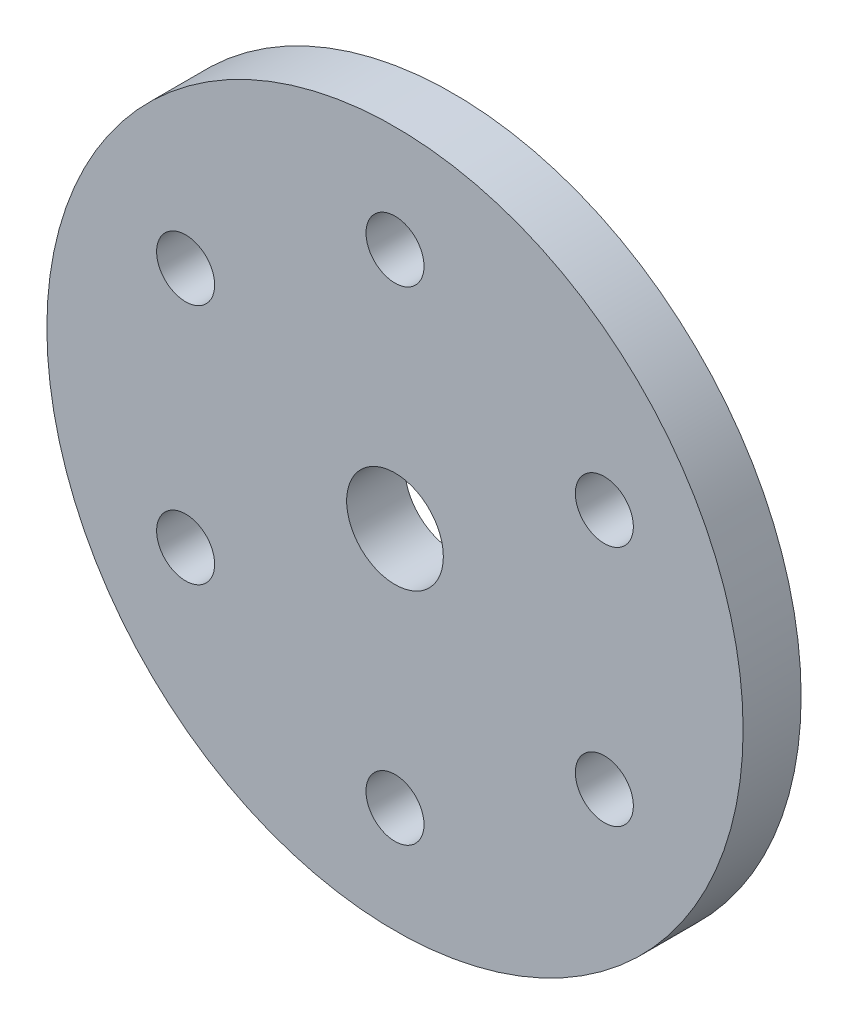
ISO-10303-21;
HEADER;
FILE_DESCRIPTION(('STEP AP214'),'2;1');
FILE_NAME('part.step','',(''),(''),'','','');
FILE_SCHEMA(('AUTOMOTIVE_DESIGN { 1 0 10303 214 1 1 1 1 }'));
ENDSEC;
DATA;
#1=APPLICATION_CONTEXT('core data for automotive mechanical design processes');
#2=APPLICATION_PROTOCOL_DEFINITION('international standard','automotive_design',2000,#1);
#3=PRODUCT_CONTEXT('',#1,'mechanical');
#4=PRODUCT('Part','Part','',(#3));
#5=PRODUCT_RELATED_PRODUCT_CATEGORY('part','',(#4));
#6=PRODUCT_DEFINITION_FORMATION('','',#4);
#7=PRODUCT_DEFINITION_CONTEXT('part definition',#1,'design');
#8=PRODUCT_DEFINITION('design','',#6,#7);
#9=PRODUCT_DEFINITION_SHAPE('','',#8);
#10=(LENGTH_UNIT() NAMED_UNIT(*) SI_UNIT(.MILLI.,.METRE.));
#11=(NAMED_UNIT(*) PLANE_ANGLE_UNIT() SI_UNIT($,.RADIAN.));
#12=(NAMED_UNIT(*) SI_UNIT($,.STERADIAN.) SOLID_ANGLE_UNIT());
#13=UNCERTAINTY_MEASURE_WITH_UNIT(LENGTH_MEASURE(1.E-05),#10,'distance_accuracy_value','');
#14=(GEOMETRIC_REPRESENTATION_CONTEXT(3) GLOBAL_UNCERTAINTY_ASSIGNED_CONTEXT((#13)) GLOBAL_UNIT_ASSIGNED_CONTEXT((#10,
#11,#12)) REPRESENTATION_CONTEXT('',''));
#15=CARTESIAN_POINT('',(0.,0.,0.));
#16=DIRECTION('',(0.,0.,1.));
#17=DIRECTION('',(1.,0.,0.));
#18=AXIS2_PLACEMENT_3D('',#15,#16,#17);
#19=CARTESIAN_POINT('',(0.,0.,3.));
#20=DIRECTION('',(0.,0.,1.));
#21=DIRECTION('',(1.,0.,0.));
#22=AXIS2_PLACEMENT_3D('',#19,#20,#21);
#23=PLANE('',#22);
#24=CARTESIAN_POINT('',(-10.8253175473024,-6.25000000000178,3.));
#25=DIRECTION('',(0.,0.,1.));
#26=DIRECTION('',(1.,0.,0.));
#27=AXIS2_PLACEMENT_3D('',#24,#25,#26);
#28=CIRCLE('',#27,1.5);
#29=CARTESIAN_POINT('',(-9.32531754730242,-6.25000000000178,3.));
#30=VERTEX_POINT('',#29);
#31=EDGE_CURVE('E71',#30,#30,#28,.T.);
#32=ORIENTED_EDGE('',*,*,#31,.F.);
#33=EDGE_LOOP('',(#32));
#34=FACE_BOUND('',#33,.T.);
#35=CARTESIAN_POINT('',(10.8253175473086,-6.24999999999823,3.));
#36=DIRECTION('',(0.,0.,1.));
#37=DIRECTION('',(1.,0.,0.));
#38=AXIS2_PLACEMENT_3D('',#35,#36,#37);
#39=CIRCLE('',#38,1.5);
#40=CARTESIAN_POINT('',(12.3253175473086,-6.24999999999823,3.));
#41=VERTEX_POINT('',#40);
#42=EDGE_CURVE('E59',#41,#41,#39,.T.);
#43=ORIENTED_EDGE('',*,*,#42,.F.);
#44=EDGE_LOOP('',(#43));
#45=FACE_BOUND('',#44,.T.);
#46=CARTESIAN_POINT('',(0.,0.,3.));
#47=DIRECTION('',(0.,0.,1.));
#48=DIRECTION('',(1.,0.,0.));
#49=AXIS2_PLACEMENT_3D('',#46,#47,#48);
#50=CIRCLE('',#49,2.5);
#51=CARTESIAN_POINT('',(2.5,0.,3.));
#52=VERTEX_POINT('',#51);
#53=EDGE_CURVE('E47',#52,#52,#50,.T.);
#54=ORIENTED_EDGE('',*,*,#53,.F.);
#55=EDGE_LOOP('',(#54));
#56=FACE_BOUND('',#55,.T.);
#57=CARTESIAN_POINT('',(0.,0.,3.));
#58=DIRECTION('',(0.,0.,1.));
#59=DIRECTION('',(1.,0.,0.));
#60=AXIS2_PLACEMENT_3D('',#57,#58,#59);
#61=CIRCLE('',#60,18.);
#62=CARTESIAN_POINT('',(18.,0.,3.));
#63=VERTEX_POINT('',#62);
#64=EDGE_CURVE('E10',#63,#63,#61,.T.);
#65=ORIENTED_EDGE('',*,*,#64,.T.);
#66=EDGE_LOOP('',(#65));
#67=FACE_BOUND('',#66,.T.);
#68=CARTESIAN_POINT('',(0.,12.5,3.));
#69=DIRECTION('',(0.,0.,1.));
#70=DIRECTION('',(1.,0.,0.));
#71=AXIS2_PLACEMENT_3D('',#68,#69,#70);
#72=CIRCLE('',#71,1.5);
#73=CARTESIAN_POINT('',(1.5,12.5,3.));
#74=VERTEX_POINT('',#73);
#75=EDGE_CURVE('E42',#74,#74,#72,.T.);
#76=ORIENTED_EDGE('',*,*,#75,.F.);
#77=EDGE_LOOP('',(#76));
#78=FACE_BOUND('',#77,.T.);
#79=CARTESIAN_POINT('',(10.8253175473065,6.25000000000177,3.));
#80=DIRECTION('',(0.,0.,1.));
#81=DIRECTION('',(1.,0.,0.));
#82=AXIS2_PLACEMENT_3D('',#79,#80,#81);
#83=CIRCLE('',#82,1.5);
#84=CARTESIAN_POINT('',(12.3253175473065,6.25000000000177,3.));
#85=VERTEX_POINT('',#84);
#86=EDGE_CURVE('E53',#85,#85,#83,.T.);
#87=ORIENTED_EDGE('',*,*,#86,.F.);
#88=EDGE_LOOP('',(#87));
#89=FACE_BOUND('',#88,.T.);
#90=CARTESIAN_POINT('',(4.0883786618412E-12,-12.5,3.));
#91=DIRECTION('',(0.,0.,1.));
#92=DIRECTION('',(1.,0.,0.));
#93=AXIS2_PLACEMENT_3D('',#90,#91,#92);
#94=CIRCLE('',#93,1.5);
#95=CARTESIAN_POINT('',(1.50000000000409,-12.5,3.));
#96=VERTEX_POINT('',#95);
#97=EDGE_CURVE('E65',#96,#96,#94,.T.);
#98=ORIENTED_EDGE('',*,*,#97,.F.);
#99=EDGE_LOOP('',(#98));
#100=FACE_BOUND('',#99,.T.);
#101=CARTESIAN_POINT('',(-10.8253175473045,6.24999999999822,3.));
#102=DIRECTION('',(0.,0.,1.));
#103=DIRECTION('',(1.,0.,0.));
#104=AXIS2_PLACEMENT_3D('',#101,#102,#103);
#105=CIRCLE('',#104,1.5);
#106=CARTESIAN_POINT('',(-9.32531754730446,6.24999999999822,3.));
#107=VERTEX_POINT('',#106);
#108=EDGE_CURVE('E77',#107,#107,#105,.T.);
#109=ORIENTED_EDGE('',*,*,#108,.F.);
#110=EDGE_LOOP('',(#109));
#111=FACE_BOUND('',#110,.T.);
#112=ADVANCED_FACE('F31',(#34,#45,#56,#67,#78,#89,#100,#111),#23,.T.);
#113=CARTESIAN_POINT('',(0.,0.,0.));
#114=DIRECTION('',(0.,0.,1.));
#115=DIRECTION('',(1.,0.,0.));
#116=AXIS2_PLACEMENT_3D('',#113,#114,#115);
#117=PLANE('',#116);
#118=CARTESIAN_POINT('',(0.,0.,0.));
#119=DIRECTION('',(0.,0.,1.));
#120=DIRECTION('',(1.,0.,0.));
#121=AXIS2_PLACEMENT_3D('',#118,#119,#120);
#122=CIRCLE('',#121,18.);
#123=CARTESIAN_POINT('',(18.,0.,0.));
#124=VERTEX_POINT('',#123);
#125=EDGE_CURVE('E35',#124,#124,#122,.T.);
#126=ORIENTED_EDGE('',*,*,#125,.F.);
#127=EDGE_LOOP('',(#126));
#128=FACE_BOUND('',#127,.T.);
#129=CARTESIAN_POINT('',(0.,12.5,0.));
#130=DIRECTION('',(0.,0.,1.));
#131=DIRECTION('',(1.,0.,0.));
#132=AXIS2_PLACEMENT_3D('',#129,#130,#131);
#133=CIRCLE('',#132,1.5);
#134=CARTESIAN_POINT('',(1.5,12.5,0.));
#135=VERTEX_POINT('',#134);
#136=EDGE_CURVE('E44',#135,#135,#133,.T.);
#137=ORIENTED_EDGE('',*,*,#136,.T.);
#138=EDGE_LOOP('',(#137));
#139=FACE_BOUND('',#138,.T.);
#140=CARTESIAN_POINT('',(0.,0.,0.));
#141=DIRECTION('',(0.,0.,1.));
#142=DIRECTION('',(1.,0.,0.));
#143=AXIS2_PLACEMENT_3D('',#140,#141,#142);
#144=CIRCLE('',#143,2.5);
#145=CARTESIAN_POINT('',(2.5,0.,0.));
#146=VERTEX_POINT('',#145);
#147=EDGE_CURVE('E50',#146,#146,#144,.T.);
#148=ORIENTED_EDGE('',*,*,#147,.T.);
#149=EDGE_LOOP('',(#148));
#150=FACE_BOUND('',#149,.T.);
#151=CARTESIAN_POINT('',(10.8253175473065,6.25000000000177,0.));
#152=DIRECTION('',(0.,0.,1.));
#153=DIRECTION('',(1.,0.,0.));
#154=AXIS2_PLACEMENT_3D('',#151,#152,#153);
#155=CIRCLE('',#154,1.5);
#156=CARTESIAN_POINT('',(12.3253175473065,6.25000000000177,0.));
#157=VERTEX_POINT('',#156);
#158=EDGE_CURVE('E56',#157,#157,#155,.T.);
#159=ORIENTED_EDGE('',*,*,#158,.T.);
#160=EDGE_LOOP('',(#159));
#161=FACE_BOUND('',#160,.T.);
#162=CARTESIAN_POINT('',(10.8253175473086,-6.24999999999823,0.));
#163=DIRECTION('',(0.,0.,1.));
#164=DIRECTION('',(1.,0.,0.));
#165=AXIS2_PLACEMENT_3D('',#162,#163,#164);
#166=CIRCLE('',#165,1.5);
#167=CARTESIAN_POINT('',(12.3253175473086,-6.24999999999823,0.));
#168=VERTEX_POINT('',#167);
#169=EDGE_CURVE('E62',#168,#168,#166,.T.);
#170=ORIENTED_EDGE('',*,*,#169,.T.);
#171=EDGE_LOOP('',(#170));
#172=FACE_BOUND('',#171,.T.);
#173=CARTESIAN_POINT('',(4.0883786618412E-12,-12.5,0.));
#174=DIRECTION('',(0.,0.,1.));
#175=DIRECTION('',(1.,0.,0.));
#176=AXIS2_PLACEMENT_3D('',#173,#174,#175);
#177=CIRCLE('',#176,1.5);
#178=CARTESIAN_POINT('',(1.50000000000409,-12.5,0.));
#179=VERTEX_POINT('',#178);
#180=EDGE_CURVE('E68',#179,#179,#177,.T.);
#181=ORIENTED_EDGE('',*,*,#180,.T.);
#182=EDGE_LOOP('',(#181));
#183=FACE_BOUND('',#182,.T.);
#184=CARTESIAN_POINT('',(-10.8253175473024,-6.25000000000178,0.));
#185=DIRECTION('',(0.,0.,1.));
#186=DIRECTION('',(1.,0.,0.));
#187=AXIS2_PLACEMENT_3D('',#184,#185,#186);
#188=CIRCLE('',#187,1.5);
#189=CARTESIAN_POINT('',(-9.32531754730242,-6.25000000000178,0.));
#190=VERTEX_POINT('',#189);
#191=EDGE_CURVE('E74',#190,#190,#188,.T.);
#192=ORIENTED_EDGE('',*,*,#191,.T.);
#193=EDGE_LOOP('',(#192));
#194=FACE_BOUND('',#193,.T.);
#195=CARTESIAN_POINT('',(-10.8253175473045,6.24999999999822,0.));
#196=DIRECTION('',(0.,0.,1.));
#197=DIRECTION('',(1.,0.,0.));
#198=AXIS2_PLACEMENT_3D('',#195,#196,#197);
#199=CIRCLE('',#198,1.5);
#200=CARTESIAN_POINT('',(-9.32531754730446,6.24999999999822,0.));
#201=VERTEX_POINT('',#200);
#202=EDGE_CURVE('E80',#201,#201,#199,.T.);
#203=ORIENTED_EDGE('',*,*,#202,.T.);
#204=EDGE_LOOP('',(#203));
#205=FACE_BOUND('',#204,.T.);
#206=ADVANCED_FACE('F90',(#128,#139,#150,#161,#172,#183,#194,#205),#117,.F.);
#207=CARTESIAN_POINT('',(0.,0.,3.));
#208=DIRECTION('',(0.,0.,-1.));
#209=DIRECTION('',(-1.,0.,0.));
#210=AXIS2_PLACEMENT_3D('',#207,#208,#209);
#211=CYLINDRICAL_SURFACE('',#210,18.);
#212=ORIENTED_EDGE('',*,*,#64,.F.);
#213=EDGE_LOOP('',(#212));
#214=FACE_BOUND('',#213,.T.);
#215=ORIENTED_EDGE('',*,*,#125,.T.);
#216=EDGE_LOOP('',(#215));
#217=FACE_BOUND('',#216,.T.);
#218=ADVANCED_FACE('F33',(#214,#217),#211,.T.);
#219=CARTESIAN_POINT('',(0.,12.5,3.));
#220=DIRECTION('',(0.,0.,-1.));
#221=DIRECTION('',(-1.,0.,0.));
#222=AXIS2_PLACEMENT_3D('',#219,#220,#221);
#223=CYLINDRICAL_SURFACE('',#222,1.5);
#224=ORIENTED_EDGE('',*,*,#75,.T.);
#225=EDGE_LOOP('',(#224));
#226=FACE_BOUND('',#225,.T.);
#227=ORIENTED_EDGE('',*,*,#136,.F.);
#228=EDGE_LOOP('',(#227));
#229=FACE_BOUND('',#228,.T.);
#230=ADVANCED_FACE('F100',(#226,#229),#223,.F.);
#231=CARTESIAN_POINT('',(0.,0.,3.));
#232=DIRECTION('',(0.,0.,-1.));
#233=DIRECTION('',(-1.,0.,0.));
#234=AXIS2_PLACEMENT_3D('',#231,#232,#233);
#235=CYLINDRICAL_SURFACE('',#234,2.5);
#236=ORIENTED_EDGE('',*,*,#53,.T.);
#237=EDGE_LOOP('',(#236));
#238=FACE_BOUND('',#237,.T.);
#239=ORIENTED_EDGE('',*,*,#147,.F.);
#240=EDGE_LOOP('',(#239));
#241=FACE_BOUND('',#240,.T.);
#242=ADVANCED_FACE('F103',(#238,#241),#235,.F.);
#243=CARTESIAN_POINT('',(10.8253175473065,6.25000000000177,3.));
#244=DIRECTION('',(0.,0.,-1.));
#245=DIRECTION('',(-1.,0.,0.));
#246=AXIS2_PLACEMENT_3D('',#243,#244,#245);
#247=CYLINDRICAL_SURFACE('',#246,1.5);
#248=ORIENTED_EDGE('',*,*,#86,.T.);
#249=EDGE_LOOP('',(#248));
#250=FACE_BOUND('',#249,.T.);
#251=ORIENTED_EDGE('',*,*,#158,.F.);
#252=EDGE_LOOP('',(#251));
#253=FACE_BOUND('',#252,.T.);
#254=ADVANCED_FACE('F107',(#250,#253),#247,.F.);
#255=CARTESIAN_POINT('',(10.8253175473086,-6.24999999999823,3.));
#256=DIRECTION('',(0.,0.,-1.));
#257=DIRECTION('',(-1.,0.,0.));
#258=AXIS2_PLACEMENT_3D('',#255,#256,#257);
#259=CYLINDRICAL_SURFACE('',#258,1.5);
#260=ORIENTED_EDGE('',*,*,#42,.T.);
#261=EDGE_LOOP('',(#260));
#262=FACE_BOUND('',#261,.T.);
#263=ORIENTED_EDGE('',*,*,#169,.F.);
#264=EDGE_LOOP('',(#263));
#265=FACE_BOUND('',#264,.T.);
#266=ADVANCED_FACE('F111',(#262,#265),#259,.F.);
#267=CARTESIAN_POINT('',(4.0883786618412E-12,-12.5,3.));
#268=DIRECTION('',(0.,0.,-1.));
#269=DIRECTION('',(-1.,0.,0.));
#270=AXIS2_PLACEMENT_3D('',#267,#268,#269);
#271=CYLINDRICAL_SURFACE('',#270,1.5);
#272=ORIENTED_EDGE('',*,*,#97,.T.);
#273=EDGE_LOOP('',(#272));
#274=FACE_BOUND('',#273,.T.);
#275=ORIENTED_EDGE('',*,*,#180,.F.);
#276=EDGE_LOOP('',(#275));
#277=FACE_BOUND('',#276,.T.);
#278=ADVANCED_FACE('F115',(#274,#277),#271,.F.);
#279=CARTESIAN_POINT('',(-10.8253175473024,-6.25000000000178,3.));
#280=DIRECTION('',(0.,0.,-1.));
#281=DIRECTION('',(-1.,0.,0.));
#282=AXIS2_PLACEMENT_3D('',#279,#280,#281);
#283=CYLINDRICAL_SURFACE('',#282,1.5);
#284=ORIENTED_EDGE('',*,*,#31,.T.);
#285=EDGE_LOOP('',(#284));
#286=FACE_BOUND('',#285,.T.);
#287=ORIENTED_EDGE('',*,*,#191,.F.);
#288=EDGE_LOOP('',(#287));
#289=FACE_BOUND('',#288,.T.);
#290=ADVANCED_FACE('F119',(#286,#289),#283,.F.);
#291=CARTESIAN_POINT('',(-10.8253175473045,6.24999999999822,3.));
#292=DIRECTION('',(0.,0.,-1.));
#293=DIRECTION('',(-1.,0.,0.));
#294=AXIS2_PLACEMENT_3D('',#291,#292,#293);
#295=CYLINDRICAL_SURFACE('',#294,1.5);
#296=ORIENTED_EDGE('',*,*,#108,.T.);
#297=EDGE_LOOP('',(#296));
#298=FACE_BOUND('',#297,.T.);
#299=ORIENTED_EDGE('',*,*,#202,.F.);
#300=EDGE_LOOP('',(#299));
#301=FACE_BOUND('',#300,.T.);
#302=ADVANCED_FACE('F86',(#298,#301),#295,.F.);
#303=CLOSED_SHELL('',(#112,#206,#218,#230,#242,#254,#266,#278,#290,#302));
#304=MANIFOLD_SOLID_BREP('B2',#303);
#305=ADVANCED_BREP_SHAPE_REPRESENTATION('',(#18,#304),#14);
#306=SHAPE_DEFINITION_REPRESENTATION(#9,#305);
ENDSEC;
END-ISO-10303-21;
